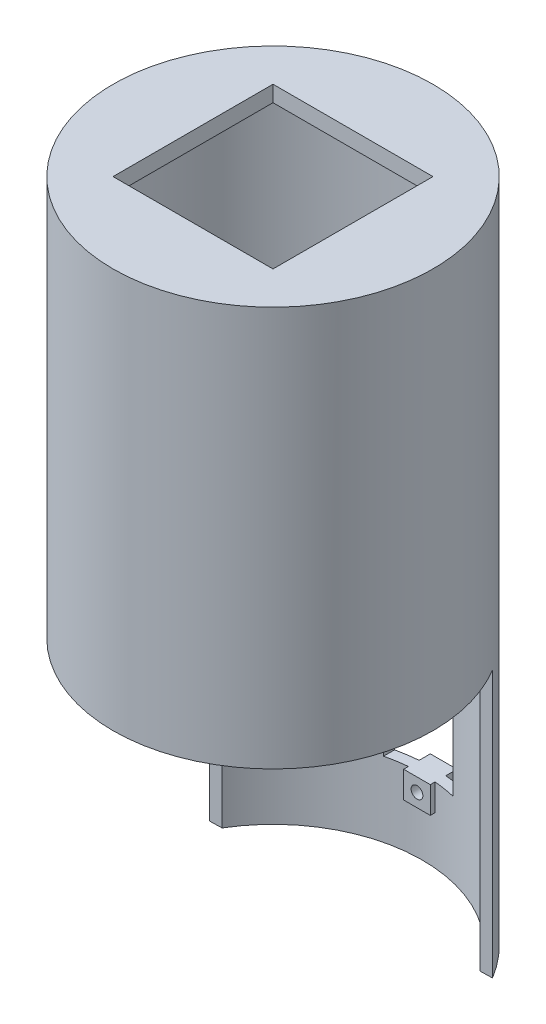
ISO-10303-21;
HEADER;
FILE_DESCRIPTION(('STEP AP214'),'2;1');
FILE_NAME('part.step','',(''),(''),'','','');
FILE_SCHEMA(('AUTOMOTIVE_DESIGN { 1 0 10303 214 1 1 1 1 }'));
ENDSEC;
DATA;
#1=APPLICATION_CONTEXT('core data for automotive mechanical design processes');
#2=APPLICATION_PROTOCOL_DEFINITION('international standard','automotive_design',2000,#1);
#3=PRODUCT_CONTEXT('',#1,'mechanical');
#4=PRODUCT('Part','Part','',(#3));
#5=PRODUCT_RELATED_PRODUCT_CATEGORY('part','',(#4));
#6=PRODUCT_DEFINITION_FORMATION('','',#4);
#7=PRODUCT_DEFINITION_CONTEXT('part definition',#1,'design');
#8=PRODUCT_DEFINITION('design','',#6,#7);
#9=PRODUCT_DEFINITION_SHAPE('','',#8);
#10=(LENGTH_UNIT() NAMED_UNIT(*) SI_UNIT(.MILLI.,.METRE.));
#11=(NAMED_UNIT(*) PLANE_ANGLE_UNIT() SI_UNIT($,.RADIAN.));
#12=(NAMED_UNIT(*) SI_UNIT($,.STERADIAN.) SOLID_ANGLE_UNIT());
#13=UNCERTAINTY_MEASURE_WITH_UNIT(LENGTH_MEASURE(1.E-05),#10,'distance_accuracy_value','');
#14=(GEOMETRIC_REPRESENTATION_CONTEXT(3) GLOBAL_UNCERTAINTY_ASSIGNED_CONTEXT((#13)) GLOBAL_UNIT_ASSIGNED_CONTEXT((#10,
#11,#12)) REPRESENTATION_CONTEXT('',''));
#15=CARTESIAN_POINT('',(0.,0.,0.));
#16=DIRECTION('',(0.,0.,1.));
#17=DIRECTION('',(1.,0.,0.));
#18=AXIS2_PLACEMENT_3D('',#15,#16,#17);
#19=CARTESIAN_POINT('',(0.,-50.,0.));
#20=DIRECTION('',(0.,1.,0.));
#21=DIRECTION('',(0.,0.,1.));
#22=AXIS2_PLACEMENT_3D('',#19,#20,#21);
#23=CYLINDRICAL_SURFACE('',#22,30.);
#24=DIRECTION('',(0.,1.,0.));
#25=VECTOR('',#24,1.);
#26=CARTESIAN_POINT('',(-26.3258578801565,-54.,-14.385729278483));
#27=LINE('',#26,#25);
#28=CARTESIAN_POINT('',(-26.3258578801565,-50.,-14.3857292784829));
#29=VERTEX_POINT('',#28);
#30=CARTESIAN_POINT('',(-26.3258578801565,0.,-14.385729278483));
#31=VERTEX_POINT('',#30);
#32=EDGE_CURVE('E439',#29,#31,#27,.T.);
#33=ORIENTED_EDGE('',*,*,#32,.T.);
#34=CARTESIAN_POINT('',(0.,0.,0.));
#35=DIRECTION('',(0.,1.,0.));
#36=DIRECTION('',(0.,0.,1.));
#37=AXIS2_PLACEMENT_3D('',#34,#35,#36);
#38=CIRCLE('',#37,30.);
#39=CARTESIAN_POINT('',(25.7323164153394,0.,-15.4223179807983));
#40=VERTEX_POINT('',#39);
#41=EDGE_CURVE('E429',#31,#40,#38,.T.);
#42=ORIENTED_EDGE('',*,*,#41,.T.);
#43=DIRECTION('',(0.,1.,0.));
#44=VECTOR('',#43,1.);
#45=CARTESIAN_POINT('',(25.7323164153394,-54.,-15.4223179807983));
#46=LINE('',#45,#44);
#47=CARTESIAN_POINT('',(25.7323164153394,-50.,-15.4223179807983));
#48=VERTEX_POINT('',#47);
#49=EDGE_CURVE('E438',#48,#40,#46,.T.);
#50=ORIENTED_EDGE('',*,*,#49,.F.);
#51=CARTESIAN_POINT('',(0.,-50.,0.));
#52=DIRECTION('',(0.,1.,0.));
#53=DIRECTION('',(0.,0.,1.));
#54=AXIS2_PLACEMENT_3D('',#51,#52,#53);
#55=CIRCLE('',#54,30.);
#56=EDGE_CURVE('E482',#48,#29,#55,.T.);
#57=ORIENTED_EDGE('',*,*,#56,.T.);
#58=EDGE_LOOP('',(#33,#42,#50,#57));
#59=FACE_BOUND('',#58,.T.);
#60=CARTESIAN_POINT('',(0.,75.,0.));
#61=DIRECTION('',(0.,1.,0.));
#62=DIRECTION('',(0.,0.,1.));
#63=AXIS2_PLACEMENT_3D('',#60,#61,#62);
#64=CIRCLE('',#63,30.);
#65=CARTESIAN_POINT('',(0.,75.,30.));
#66=VERTEX_POINT('',#65);
#67=EDGE_CURVE('E470',#66,#66,#64,.T.);
#68=ORIENTED_EDGE('',*,*,#67,.F.);
#69=EDGE_LOOP('',(#68));
#70=FACE_BOUND('',#69,.T.);
#71=CARTESIAN_POINT('',(0.,-41.,0.));
#72=DIRECTION('',(0.,1.,0.));
#73=DIRECTION('',(0.,0.,1.));
#74=AXIS2_PLACEMENT_3D('',#71,#72,#73);
#75=CIRCLE('',#74,30.);
#76=CARTESIAN_POINT('',(-2.5,-41.,-29.8956518577535));
#77=VERTEX_POINT('',#76);
#78=CARTESIAN_POINT('',(2.5,-41.,-29.8956518577535));
#79=VERTEX_POINT('',#78);
#80=EDGE_CURVE('E306',#77,#79,#75,.F.);
#81=ORIENTED_EDGE('',*,*,#80,.T.);
#82=DIRECTION('',(0.,1.,0.));
#83=VECTOR('',#82,1.);
#84=CARTESIAN_POINT('',(2.5,-50.,-29.8956518577535));
#85=LINE('',#84,#83);
#86=CARTESIAN_POINT('',(2.5,-36.,-29.8956518577535));
#87=VERTEX_POINT('',#86);
#88=EDGE_CURVE('E303',#79,#87,#85,.T.);
#89=ORIENTED_EDGE('',*,*,#88,.T.);
#90=CARTESIAN_POINT('',(0.,-36.,0.));
#91=DIRECTION('',(0.,-1.,0.));
#92=DIRECTION('',(0.,0.,-1.));
#93=AXIS2_PLACEMENT_3D('',#90,#91,#92);
#94=CIRCLE('',#93,30.);
#95=CARTESIAN_POINT('',(6.50000000000001,-36.,-29.2873692912149));
#96=VERTEX_POINT('',#95);
#97=EDGE_CURVE('E234',#96,#87,#94,.F.);
#98=ORIENTED_EDGE('',*,*,#97,.F.);
#99=DIRECTION('',(0.,1.,0.));
#100=VECTOR('',#99,1.);
#101=CARTESIAN_POINT('',(6.50000000000001,-50.,-29.2873692912149));
#102=LINE('',#101,#100);
#103=CARTESIAN_POINT('',(6.5,-12.5,-29.2873692912149));
#104=VERTEX_POINT('',#103);
#105=EDGE_CURVE('E395',#104,#96,#102,.F.);
#106=ORIENTED_EDGE('',*,*,#105,.F.);
#107=CARTESIAN_POINT('',(0.,-12.5,0.));
#108=DIRECTION('',(0.,1.,0.));
#109=DIRECTION('',(0.,0.,1.));
#110=AXIS2_PLACEMENT_3D('',#107,#108,#109);
#111=CIRCLE('',#110,30.);
#112=CARTESIAN_POINT('',(2.5,-12.5,-29.8956518577535));
#113=VERTEX_POINT('',#112);
#114=EDGE_CURVE('E399',#113,#104,#111,.F.);
#115=ORIENTED_EDGE('',*,*,#114,.F.);
#116=DIRECTION('',(0.,1.,0.));
#117=VECTOR('',#116,1.);
#118=CARTESIAN_POINT('',(2.5,-50.,-29.8956518577535));
#119=LINE('',#118,#117);
#120=CARTESIAN_POINT('',(2.5,-7.50000000000001,-29.8956518577535));
#121=VERTEX_POINT('',#120);
#122=EDGE_CURVE('E369',#113,#121,#119,.T.);
#123=ORIENTED_EDGE('',*,*,#122,.T.);
#124=CARTESIAN_POINT('',(0.,-7.50000000000001,0.));
#125=DIRECTION('',(0.,-1.,0.));
#126=DIRECTION('',(0.,0.,-1.));
#127=AXIS2_PLACEMENT_3D('',#124,#125,#126);
#128=CIRCLE('',#127,30.);
#129=CARTESIAN_POINT('',(-2.5,-7.5,-29.8956518577535));
#130=VERTEX_POINT('',#129);
#131=EDGE_CURVE('E373',#121,#130,#128,.F.);
#132=ORIENTED_EDGE('',*,*,#131,.T.);
#133=DIRECTION('',(0.,1.,0.));
#134=VECTOR('',#133,1.);
#135=CARTESIAN_POINT('',(-2.49999999999999,-50.,-29.8956518577535));
#136=LINE('',#135,#134);
#137=CARTESIAN_POINT('',(-2.5,-12.5,-29.8956518577535));
#138=VERTEX_POINT('',#137);
#139=EDGE_CURVE('E361',#130,#138,#136,.F.);
#140=ORIENTED_EDGE('',*,*,#139,.T.);
#141=CARTESIAN_POINT('',(-6.5,-12.5,-29.2873692912149));
#142=VERTEX_POINT('',#141);
#143=EDGE_CURVE('E400',#142,#138,#111,.F.);
#144=ORIENTED_EDGE('',*,*,#143,.F.);
#145=DIRECTION('',(0.,1.,0.));
#146=VECTOR('',#145,1.);
#147=CARTESIAN_POINT('',(-6.49999999999999,-50.,-29.2873692912149));
#148=LINE('',#147,#146);
#149=CARTESIAN_POINT('',(-6.49999999999999,-36.,-29.2873692912149));
#150=VERTEX_POINT('',#149);
#151=EDGE_CURVE('E404',#150,#142,#148,.T.);
#152=ORIENTED_EDGE('',*,*,#151,.F.);
#153=CARTESIAN_POINT('',(-2.5,-36.,-29.8956518577535));
#154=VERTEX_POINT('',#153);
#155=EDGE_CURVE('E382',#154,#150,#94,.F.);
#156=ORIENTED_EDGE('',*,*,#155,.F.);
#157=DIRECTION('',(0.,1.,0.));
#158=VECTOR('',#157,1.);
#159=CARTESIAN_POINT('',(-2.5,-50.,-29.8956518577535));
#160=LINE('',#159,#158);
#161=EDGE_CURVE('E295',#154,#77,#160,.F.);
#162=ORIENTED_EDGE('',*,*,#161,.T.);
#163=EDGE_LOOP('',(#81,#89,#98,#106,#115,#123,#132,#140,#144,#152,#156,#162));
#164=FACE_BOUND('',#163,.T.);
#165=ADVANCED_FACE('F39',(#59,#70,#164),#23,.T.);
#166=CARTESIAN_POINT('',(0.,72.,0.));
#167=DIRECTION('',(0.,-1.,0.));
#168=DIRECTION('',(0.,0.,-1.));
#169=AXIS2_PLACEMENT_3D('',#166,#167,#168);
#170=CYLINDRICAL_SURFACE('',#169,28.);
#171=CARTESIAN_POINT('',(0.,72.,0.));
#172=DIRECTION('',(0.,1.,0.));
#173=DIRECTION('',(0.,0.,1.));
#174=AXIS2_PLACEMENT_3D('',#171,#172,#173);
#175=CIRCLE('',#174,28.);
#176=CARTESIAN_POINT('',(0.,72.,28.));
#177=VERTEX_POINT('',#176);
#178=EDGE_CURVE('E407',#177,#177,#175,.T.);
#179=ORIENTED_EDGE('',*,*,#178,.T.);
#180=EDGE_LOOP('',(#179));
#181=FACE_BOUND('',#180,.T.);
#182=DIRECTION('',(0.,-1.,0.));
#183=VECTOR('',#182,1.);
#184=CARTESIAN_POINT('',(23.4004728342361,72.,-15.3758860276142));
#185=LINE('',#184,#183);
#186=CARTESIAN_POINT('',(23.4004728342361,-50.,-15.3758860276142));
#187=VERTEX_POINT('',#186);
#188=CARTESIAN_POINT('',(23.4004728342361,0.,-15.3758860276142));
#189=VERTEX_POINT('',#188);
#190=EDGE_CURVE('E489',#187,#189,#185,.F.);
#191=ORIENTED_EDGE('',*,*,#190,.T.);
#192=CARTESIAN_POINT('',(0.,0.,0.));
#193=DIRECTION('',(0.,1.,0.));
#194=DIRECTION('',(0.,0.,1.));
#195=AXIS2_PLACEMENT_3D('',#192,#193,#194);
#196=CIRCLE('',#195,28.);
#197=CARTESIAN_POINT('',(-23.9940142990531,0.,-14.4321612316671));
#198=VERTEX_POINT('',#197);
#199=EDGE_CURVE('E411',#189,#198,#196,.F.);
#200=ORIENTED_EDGE('',*,*,#199,.T.);
#201=DIRECTION('',(0.,-1.,0.));
#202=VECTOR('',#201,1.);
#203=CARTESIAN_POINT('',(-23.9940142990531,72.,-14.432161231667));
#204=LINE('',#203,#202);
#205=CARTESIAN_POINT('',(-23.9940142990531,-50.,-14.432161231667));
#206=VERTEX_POINT('',#205);
#207=EDGE_CURVE('E486',#198,#206,#204,.T.);
#208=ORIENTED_EDGE('',*,*,#207,.T.);
#209=CARTESIAN_POINT('',(0.,-50.,0.));
#210=DIRECTION('',(0.,1.,0.));
#211=DIRECTION('',(0.,0.,1.));
#212=AXIS2_PLACEMENT_3D('',#209,#210,#211);
#213=CIRCLE('',#212,28.);
#214=EDGE_CURVE('E414',#206,#187,#213,.F.);
#215=ORIENTED_EDGE('',*,*,#214,.T.);
#216=EDGE_LOOP('',(#191,#200,#208,#215));
#217=FACE_BOUND('',#216,.T.);
#218=CARTESIAN_POINT('',(0.,-36.,0.));
#219=DIRECTION('',(0.,-1.,0.));
#220=DIRECTION('',(0.,0.,-1.));
#221=AXIS2_PLACEMENT_3D('',#218,#219,#220);
#222=CIRCLE('',#221,28.);
#223=CARTESIAN_POINT('',(2.5,-36.,-27.8881695347687));
#224=VERTEX_POINT('',#223);
#225=CARTESIAN_POINT('',(6.50000000000001,-36.,-27.2350876627926));
#226=VERTEX_POINT('',#225);
#227=EDGE_CURVE('E496',#224,#226,#222,.T.);
#228=ORIENTED_EDGE('',*,*,#227,.F.);
#229=DIRECTION('',(0.,-1.,0.));
#230=VECTOR('',#229,1.);
#231=CARTESIAN_POINT('',(2.49999999999999,72.,-27.8881695347687));
#232=LINE('',#231,#230);
#233=CARTESIAN_POINT('',(2.5,-41.,-27.8881695347687));
#234=VERTEX_POINT('',#233);
#235=EDGE_CURVE('E299',#224,#234,#232,.T.);
#236=ORIENTED_EDGE('',*,*,#235,.T.);
#237=CARTESIAN_POINT('',(0.,-41.,0.));
#238=DIRECTION('',(0.,1.,0.));
#239=DIRECTION('',(0.,0.,1.));
#240=AXIS2_PLACEMENT_3D('',#237,#238,#239);
#241=CIRCLE('',#240,28.);
#242=CARTESIAN_POINT('',(-2.5,-41.,-27.8881695347687));
#243=VERTEX_POINT('',#242);
#244=EDGE_CURVE('E11',#234,#243,#241,.T.);
#245=ORIENTED_EDGE('',*,*,#244,.T.);
#246=DIRECTION('',(0.,-1.,0.));
#247=VECTOR('',#246,1.);
#248=CARTESIAN_POINT('',(-2.49999999999999,72.,-27.8881695347687));
#249=LINE('',#248,#247);
#250=CARTESIAN_POINT('',(-2.5,-36.,-27.8881695347687));
#251=VERTEX_POINT('',#250);
#252=EDGE_CURVE('E291',#243,#251,#249,.F.);
#253=ORIENTED_EDGE('',*,*,#252,.T.);
#254=CARTESIAN_POINT('',(-6.49999999999999,-36.,-27.2350876627926));
#255=VERTEX_POINT('',#254);
#256=EDGE_CURVE('E497',#255,#251,#222,.T.);
#257=ORIENTED_EDGE('',*,*,#256,.F.);
#258=DIRECTION('',(0.,-1.,0.));
#259=VECTOR('',#258,1.);
#260=CARTESIAN_POINT('',(-6.50000000000001,72.,-27.2350876627926));
#261=LINE('',#260,#259);
#262=CARTESIAN_POINT('',(-6.5,-12.5,-27.2350876627926));
#263=VERTEX_POINT('',#262);
#264=EDGE_CURVE('E508',#263,#255,#261,.T.);
#265=ORIENTED_EDGE('',*,*,#264,.F.);
#266=CARTESIAN_POINT('',(0.,-12.5,0.));
#267=DIRECTION('',(0.,1.,0.));
#268=DIRECTION('',(0.,0.,1.));
#269=AXIS2_PLACEMENT_3D('',#266,#267,#268);
#270=CIRCLE('',#269,28.);
#271=CARTESIAN_POINT('',(-2.5,-12.5,-27.8881695347687));
#272=VERTEX_POINT('',#271);
#273=EDGE_CURVE('E503',#272,#263,#270,.T.);
#274=ORIENTED_EDGE('',*,*,#273,.F.);
#275=DIRECTION('',(0.,-1.,0.));
#276=VECTOR('',#275,1.);
#277=CARTESIAN_POINT('',(-2.50000000000002,72.,-27.8881695347687));
#278=LINE('',#277,#276);
#279=CARTESIAN_POINT('',(-2.5,-7.5,-27.8881695347687));
#280=VERTEX_POINT('',#279);
#281=EDGE_CURVE('E357',#272,#280,#278,.F.);
#282=ORIENTED_EDGE('',*,*,#281,.T.);
#283=CARTESIAN_POINT('',(0.,-7.50000000000001,0.));
#284=DIRECTION('',(0.,-1.,0.));
#285=DIRECTION('',(0.,0.,-1.));
#286=AXIS2_PLACEMENT_3D('',#283,#284,#285);
#287=CIRCLE('',#286,28.);
#288=CARTESIAN_POINT('',(2.5,-7.50000000000001,-27.8881695347687));
#289=VERTEX_POINT('',#288);
#290=EDGE_CURVE('E48',#280,#289,#287,.T.);
#291=ORIENTED_EDGE('',*,*,#290,.T.);
#292=DIRECTION('',(0.,-1.,0.));
#293=VECTOR('',#292,1.);
#294=CARTESIAN_POINT('',(2.49999999999999,72.,-27.8881695347687));
#295=LINE('',#294,#293);
#296=CARTESIAN_POINT('',(2.5,-12.5,-27.8881695347687));
#297=VERTEX_POINT('',#296);
#298=EDGE_CURVE('E365',#289,#297,#295,.T.);
#299=ORIENTED_EDGE('',*,*,#298,.T.);
#300=CARTESIAN_POINT('',(6.5,-12.5,-27.2350876627926));
#301=VERTEX_POINT('',#300);
#302=EDGE_CURVE('E504',#301,#297,#270,.T.);
#303=ORIENTED_EDGE('',*,*,#302,.F.);
#304=DIRECTION('',(0.,-1.,0.));
#305=VECTOR('',#304,1.);
#306=CARTESIAN_POINT('',(6.49999999999999,72.,-27.2350876627926));
#307=LINE('',#306,#305);
#308=EDGE_CURVE('E500',#226,#301,#307,.F.);
#309=ORIENTED_EDGE('',*,*,#308,.F.);
#310=EDGE_LOOP('',(#228,#236,#245,#253,#257,#265,#274,#282,#291,#299,#303,#309));
#311=FACE_BOUND('',#310,.T.);
#312=ADVANCED_FACE('F554',(#181,#217,#311),#170,.F.);
#313=CARTESIAN_POINT('',(25.7323164153394,-54.,-15.4223179807983));
#314=DIRECTION('',(-0.0199081753741811,0.,-0.99980181263752));
#315=DIRECTION('',(-0.99980181263752,0.,0.0199081753741811));
#316=AXIS2_PLACEMENT_3D('',#313,#314,#315);
#317=PLANE('',#316);
#318=ORIENTED_EDGE('',*,*,#190,.F.);
#319=DIRECTION('',(-0.99980181263752,0.,0.0199081753741811));
#320=VECTOR('',#319,1.);
#321=CARTESIAN_POINT('',(-0.296770732408542,-50.,-14.9040236296406));
#322=LINE('',#321,#320);
#323=EDGE_CURVE('E446',#48,#187,#322,.T.);
#324=ORIENTED_EDGE('',*,*,#323,.F.);
#325=ORIENTED_EDGE('',*,*,#49,.T.);
#326=DIRECTION('',(-0.99980181263752,0.,0.0199081753741811));
#327=VECTOR('',#326,1.);
#328=CARTESIAN_POINT('',(25.7323164153394,0.,-15.4223179807983));
#329=LINE('',#328,#327);
#330=EDGE_CURVE('E434',#40,#189,#329,.T.);
#331=ORIENTED_EDGE('',*,*,#330,.T.);
#332=EDGE_LOOP('',(#318,#324,#325,#331));
#333=FACE_BOUND('',#332,.T.);
#334=ADVANCED_FACE('F623',(#333),#317,.F.);
#335=ORIENTED_EDGE('',*,*,#207,.F.);
#336=EDGE_CURVE('E433',#198,#31,#329,.T.);
#337=ORIENTED_EDGE('',*,*,#336,.T.);
#338=ORIENTED_EDGE('',*,*,#32,.F.);
#339=EDGE_CURVE('E443',#206,#29,#322,.T.);
#340=ORIENTED_EDGE('',*,*,#339,.F.);
#341=EDGE_LOOP('',(#335,#337,#338,#340));
#342=FACE_BOUND('',#341,.T.);
#343=ADVANCED_FACE('F643',(#342),#317,.F.);
#344=CARTESIAN_POINT('',(0.,-50.,0.));
#345=DIRECTION('',(0.,1.,0.));
#346=DIRECTION('',(0.,0.,1.));
#347=AXIS2_PLACEMENT_3D('',#344,#345,#346);
#348=PLANE('',#347);
#349=ORIENTED_EDGE('',*,*,#214,.F.);
#350=ORIENTED_EDGE('',*,*,#339,.T.);
#351=ORIENTED_EDGE('',*,*,#56,.F.);
#352=ORIENTED_EDGE('',*,*,#323,.T.);
#353=EDGE_LOOP('',(#349,#350,#351,#352));
#354=FACE_BOUND('',#353,.T.);
#355=ADVANCED_FACE('F633',(#354),#348,.F.);
#356=CARTESIAN_POINT('',(0.,75.,0.));
#357=DIRECTION('',(0.,1.,0.));
#358=DIRECTION('',(0.,0.,1.));
#359=AXIS2_PLACEMENT_3D('',#356,#357,#358);
#360=PLANE('',#359);
#361=DIRECTION('',(-1.,0.,0.));
#362=VECTOR('',#361,1.);
#363=CARTESIAN_POINT('',(-15.,75.,-15.));
#364=LINE('',#363,#362);
#365=CARTESIAN_POINT('',(15.,75.,-15.));
#366=VERTEX_POINT('',#365);
#367=CARTESIAN_POINT('',(-15.,75.,-15.));
#368=VERTEX_POINT('',#367);
#369=EDGE_CURVE('E450',#366,#368,#364,.T.);
#370=ORIENTED_EDGE('',*,*,#369,.F.);
#371=DIRECTION('',(0.,0.,-1.));
#372=VECTOR('',#371,1.);
#373=CARTESIAN_POINT('',(15.,75.,-15.));
#374=LINE('',#373,#372);
#375=CARTESIAN_POINT('',(15.,75.,15.));
#376=VERTEX_POINT('',#375);
#377=EDGE_CURVE('E462',#376,#366,#374,.T.);
#378=ORIENTED_EDGE('',*,*,#377,.F.);
#379=DIRECTION('',(1.,0.,0.));
#380=VECTOR('',#379,1.);
#381=CARTESIAN_POINT('',(-15.,75.,15.));
#382=LINE('',#381,#380);
#383=CARTESIAN_POINT('',(-15.,75.,15.));
#384=VERTEX_POINT('',#383);
#385=EDGE_CURVE('E458',#384,#376,#382,.T.);
#386=ORIENTED_EDGE('',*,*,#385,.F.);
#387=DIRECTION('',(0.,0.,1.));
#388=VECTOR('',#387,1.);
#389=CARTESIAN_POINT('',(-15.,75.,-15.));
#390=LINE('',#389,#388);
#391=EDGE_CURVE('E454',#368,#384,#390,.T.);
#392=ORIENTED_EDGE('',*,*,#391,.F.);
#393=EDGE_LOOP('',(#370,#378,#386,#392));
#394=FACE_BOUND('',#393,.T.);
#395=ORIENTED_EDGE('',*,*,#67,.T.);
#396=EDGE_LOOP('',(#395));
#397=FACE_BOUND('',#396,.T.);
#398=ADVANCED_FACE('F630',(#394,#397),#360,.T.);
#399=CARTESIAN_POINT('',(-15.,29.9,-15.));
#400=DIRECTION('',(0.,0.,-1.));
#401=DIRECTION('',(-1.,0.,0.));
#402=AXIS2_PLACEMENT_3D('',#399,#400,#401);
#403=PLANE('',#402);
#404=DIRECTION('',(0.,1.,0.));
#405=VECTOR('',#404,1.);
#406=CARTESIAN_POINT('',(-15.,29.9,-15.));
#407=LINE('',#406,#405);
#408=CARTESIAN_POINT('',(-15.,72.,-15.));
#409=VERTEX_POINT('',#408);
#410=EDGE_CURVE('E466',#409,#368,#407,.T.);
#411=ORIENTED_EDGE('',*,*,#410,.F.);
#412=DIRECTION('',(1.,0.,0.));
#413=VECTOR('',#412,1.);
#414=CARTESIAN_POINT('',(-15.,72.,-15.));
#415=LINE('',#414,#413);
#416=CARTESIAN_POINT('',(15.,72.,-15.));
#417=VERTEX_POINT('',#416);
#418=EDGE_CURVE('E425',#409,#417,#415,.T.);
#419=ORIENTED_EDGE('',*,*,#418,.T.);
#420=DIRECTION('',(0.,1.,0.));
#421=VECTOR('',#420,1.);
#422=CARTESIAN_POINT('',(15.,29.9,-15.));
#423=LINE('',#422,#421);
#424=EDGE_CURVE('E467',#417,#366,#423,.T.);
#425=ORIENTED_EDGE('',*,*,#424,.T.);
#426=ORIENTED_EDGE('',*,*,#369,.T.);
#427=EDGE_LOOP('',(#411,#419,#425,#426));
#428=FACE_BOUND('',#427,.T.);
#429=ADVANCED_FACE('F632',(#428),#403,.F.);
#430=CARTESIAN_POINT('',(15.,29.9,-15.));
#431=DIRECTION('',(1.,0.,0.));
#432=DIRECTION('',(0.,0.,-1.));
#433=AXIS2_PLACEMENT_3D('',#430,#431,#432);
#434=PLANE('',#433);
#435=ORIENTED_EDGE('',*,*,#424,.F.);
#436=DIRECTION('',(0.,0.,1.));
#437=VECTOR('',#436,1.);
#438=CARTESIAN_POINT('',(15.,72.,-15.));
#439=LINE('',#438,#437);
#440=CARTESIAN_POINT('',(15.,72.,15.));
#441=VERTEX_POINT('',#440);
#442=EDGE_CURVE('E421',#417,#441,#439,.T.);
#443=ORIENTED_EDGE('',*,*,#442,.T.);
#444=DIRECTION('',(0.,1.,0.));
#445=VECTOR('',#444,1.);
#446=CARTESIAN_POINT('',(15.,29.9,15.));
#447=LINE('',#446,#445);
#448=EDGE_CURVE('E471',#441,#376,#447,.T.);
#449=ORIENTED_EDGE('',*,*,#448,.T.);
#450=ORIENTED_EDGE('',*,*,#377,.T.);
#451=EDGE_LOOP('',(#435,#443,#449,#450));
#452=FACE_BOUND('',#451,.T.);
#453=ADVANCED_FACE('F640',(#452),#434,.F.);
#454=CARTESIAN_POINT('',(-15.,29.9,15.));
#455=DIRECTION('',(0.,0.,1.));
#456=DIRECTION('',(1.,0.,0.));
#457=AXIS2_PLACEMENT_3D('',#454,#455,#456);
#458=PLANE('',#457);
#459=ORIENTED_EDGE('',*,*,#448,.F.);
#460=DIRECTION('',(-1.,0.,0.));
#461=VECTOR('',#460,1.);
#462=CARTESIAN_POINT('',(-15.,72.,15.));
#463=LINE('',#462,#461);
#464=CARTESIAN_POINT('',(-15.,72.,15.));
#465=VERTEX_POINT('',#464);
#466=EDGE_CURVE('E417',#441,#465,#463,.T.);
#467=ORIENTED_EDGE('',*,*,#466,.T.);
#468=DIRECTION('',(0.,1.,0.));
#469=VECTOR('',#468,1.);
#470=CARTESIAN_POINT('',(-15.,29.9,15.));
#471=LINE('',#470,#469);
#472=EDGE_CURVE('E474',#465,#384,#471,.T.);
#473=ORIENTED_EDGE('',*,*,#472,.T.);
#474=ORIENTED_EDGE('',*,*,#385,.T.);
#475=EDGE_LOOP('',(#459,#467,#473,#474));
#476=FACE_BOUND('',#475,.T.);
#477=ADVANCED_FACE('F651',(#476),#458,.F.);
#478=CARTESIAN_POINT('',(-15.,29.9,-15.));
#479=DIRECTION('',(-1.,0.,0.));
#480=DIRECTION('',(0.,0.,1.));
#481=AXIS2_PLACEMENT_3D('',#478,#479,#480);
#482=PLANE('',#481);
#483=ORIENTED_EDGE('',*,*,#472,.F.);
#484=DIRECTION('',(0.,0.,-1.));
#485=VECTOR('',#484,1.);
#486=CARTESIAN_POINT('',(-15.,72.,-15.));
#487=LINE('',#486,#485);
#488=EDGE_CURVE('E492',#465,#409,#487,.T.);
#489=ORIENTED_EDGE('',*,*,#488,.T.);
#490=ORIENTED_EDGE('',*,*,#410,.T.);
#491=ORIENTED_EDGE('',*,*,#391,.T.);
#492=EDGE_LOOP('',(#483,#489,#490,#491));
#493=FACE_BOUND('',#492,.T.);
#494=ADVANCED_FACE('F647',(#493),#482,.F.);
#495=CARTESIAN_POINT('',(0.,0.,0.));
#496=DIRECTION('',(0.,1.,0.));
#497=DIRECTION('',(0.,0.,1.));
#498=AXIS2_PLACEMENT_3D('',#495,#496,#497);
#499=PLANE('',#498);
#500=ORIENTED_EDGE('',*,*,#199,.F.);
#501=ORIENTED_EDGE('',*,*,#330,.F.);
#502=ORIENTED_EDGE('',*,*,#41,.F.);
#503=ORIENTED_EDGE('',*,*,#336,.F.);
#504=EDGE_LOOP('',(#500,#501,#502,#503));
#505=FACE_BOUND('',#504,.T.);
#506=ADVANCED_FACE('F650',(#505),#499,.F.);
#507=CARTESIAN_POINT('',(0.,72.,0.));
#508=DIRECTION('',(0.,1.,0.));
#509=DIRECTION('',(0.,0.,1.));
#510=AXIS2_PLACEMENT_3D('',#507,#508,#509);
#511=PLANE('',#510);
#512=ORIENTED_EDGE('',*,*,#178,.F.);
#513=EDGE_LOOP('',(#512));
#514=FACE_BOUND('',#513,.T.);
#515=ORIENTED_EDGE('',*,*,#488,.F.);
#516=ORIENTED_EDGE('',*,*,#466,.F.);
#517=ORIENTED_EDGE('',*,*,#442,.F.);
#518=ORIENTED_EDGE('',*,*,#418,.F.);
#519=EDGE_LOOP('',(#515,#516,#517,#518));
#520=FACE_BOUND('',#519,.T.);
#521=ADVANCED_FACE('F663',(#514,#520),#511,.F.);
#522=CARTESIAN_POINT('',(-6.5,-12.5,-54.));
#523=DIRECTION('',(-1.,0.,0.));
#524=DIRECTION('',(0.,-1.,0.));
#525=AXIS2_PLACEMENT_3D('',#522,#523,#524);
#526=PLANE('',#525);
#527=ORIENTED_EDGE('',*,*,#151,.T.);
#528=DIRECTION('',(0.,0.,1.));
#529=VECTOR('',#528,1.);
#530=CARTESIAN_POINT('',(-6.5,-12.5,-54.));
#531=LINE('',#530,#529);
#532=EDGE_CURVE('E378',#142,#263,#531,.T.);
#533=ORIENTED_EDGE('',*,*,#532,.T.);
#534=ORIENTED_EDGE('',*,*,#264,.T.);
#535=DIRECTION('',(0.,0.,1.));
#536=VECTOR('',#535,1.);
#537=CARTESIAN_POINT('',(-6.49999999999999,-36.,-54.));
#538=LINE('',#537,#536);
#539=EDGE_CURVE('E377',#150,#255,#538,.T.);
#540=ORIENTED_EDGE('',*,*,#539,.F.);
#541=EDGE_LOOP('',(#527,#533,#534,#540));
#542=FACE_BOUND('',#541,.T.);
#543=ADVANCED_FACE('F593',(#542),#526,.F.);
#544=CARTESIAN_POINT('',(-6.5,-12.5,-54.));
#545=DIRECTION('',(0.,1.,0.));
#546=DIRECTION('',(0.,0.,1.));
#547=AXIS2_PLACEMENT_3D('',#544,#545,#546);
#548=PLANE('',#547);
#549=ORIENTED_EDGE('',*,*,#143,.T.);
#550=DIRECTION('',(0.,0.,-1.));
#551=VECTOR('',#550,1.);
#552=CARTESIAN_POINT('',(-2.5,-12.5,-27.));
#553=LINE('',#552,#551);
#554=CARTESIAN_POINT('',(-2.5,-12.5,-32.));
#555=VERTEX_POINT('',#554);
#556=EDGE_CURVE('E343',#138,#555,#553,.T.);
#557=ORIENTED_EDGE('',*,*,#556,.T.);
#558=DIRECTION('',(1.,0.,0.));
#559=VECTOR('',#558,1.);
#560=CARTESIAN_POINT('',(2.5,-12.5,-32.));
#561=LINE('',#560,#559);
#562=CARTESIAN_POINT('',(2.5,-12.5,-32.));
#563=VERTEX_POINT('',#562);
#564=EDGE_CURVE('E322',#555,#563,#561,.T.);
#565=ORIENTED_EDGE('',*,*,#564,.T.);
#566=DIRECTION('',(0.,0.,-1.));
#567=VECTOR('',#566,1.);
#568=CARTESIAN_POINT('',(2.5,-12.5,-27.));
#569=LINE('',#568,#567);
#570=EDGE_CURVE('E339',#113,#563,#569,.T.);
#571=ORIENTED_EDGE('',*,*,#570,.F.);
#572=ORIENTED_EDGE('',*,*,#114,.T.);
#573=DIRECTION('',(0.,0.,1.));
#574=VECTOR('',#573,1.);
#575=CARTESIAN_POINT('',(6.5,-12.5,-54.));
#576=LINE('',#575,#574);
#577=EDGE_CURVE('E383',#104,#301,#576,.T.);
#578=ORIENTED_EDGE('',*,*,#577,.T.);
#579=ORIENTED_EDGE('',*,*,#302,.T.);
#580=CARTESIAN_POINT('',(2.5,-12.5,-27.));
#581=VERTEX_POINT('',#580);
#582=EDGE_CURVE('E340',#581,#297,#569,.T.);
#583=ORIENTED_EDGE('',*,*,#582,.F.);
#584=DIRECTION('',(1.,0.,0.));
#585=VECTOR('',#584,1.);
#586=CARTESIAN_POINT('',(2.5,-12.5,-27.));
#587=LINE('',#586,#585);
#588=CARTESIAN_POINT('',(-2.5,-12.5,-27.));
#589=VERTEX_POINT('',#588);
#590=EDGE_CURVE('E336',#589,#581,#587,.T.);
#591=ORIENTED_EDGE('',*,*,#590,.F.);
#592=EDGE_CURVE('E344',#589,#272,#553,.T.);
#593=ORIENTED_EDGE('',*,*,#592,.T.);
#594=ORIENTED_EDGE('',*,*,#273,.T.);
#595=ORIENTED_EDGE('',*,*,#532,.F.);
#596=EDGE_LOOP('',(#549,#557,#565,#571,#572,#578,#579,#583,#591,#593,#594,#595));
#597=FACE_BOUND('',#596,.T.);
#598=ADVANCED_FACE('F563',(#597),#548,.F.);
#599=CARTESIAN_POINT('',(6.5,-12.5,-54.));
#600=DIRECTION('',(1.,0.,0.));
#601=DIRECTION('',(0.,1.,0.));
#602=AXIS2_PLACEMENT_3D('',#599,#600,#601);
#603=PLANE('',#602);
#604=ORIENTED_EDGE('',*,*,#105,.T.);
#605=DIRECTION('',(0.,0.,1.));
#606=VECTOR('',#605,1.);
#607=CARTESIAN_POINT('',(6.50000000000001,-36.,-54.));
#608=LINE('',#607,#606);
#609=EDGE_CURVE('E387',#96,#226,#608,.T.);
#610=ORIENTED_EDGE('',*,*,#609,.T.);
#611=ORIENTED_EDGE('',*,*,#308,.T.);
#612=ORIENTED_EDGE('',*,*,#577,.F.);
#613=EDGE_LOOP('',(#604,#610,#611,#612));
#614=FACE_BOUND('',#613,.T.);
#615=ADVANCED_FACE('F567',(#614),#603,.F.);
#616=CARTESIAN_POINT('',(-6.49999999999999,-36.,-54.));
#617=DIRECTION('',(0.,-1.,0.));
#618=DIRECTION('',(0.,0.,-1.));
#619=AXIS2_PLACEMENT_3D('',#616,#617,#618);
#620=PLANE('',#619);
#621=ORIENTED_EDGE('',*,*,#256,.T.);
#622=DIRECTION('',(0.,0.,-1.));
#623=VECTOR('',#622,1.);
#624=CARTESIAN_POINT('',(-2.5,-36.,-27.));
#625=LINE('',#624,#623);
#626=CARTESIAN_POINT('',(-2.5,-36.,-27.));
#627=VERTEX_POINT('',#626);
#628=EDGE_CURVE('E240',#627,#251,#625,.T.);
#629=ORIENTED_EDGE('',*,*,#628,.F.);
#630=DIRECTION('',(-1.,0.,0.));
#631=VECTOR('',#630,1.);
#632=CARTESIAN_POINT('',(2.5,-36.,-27.));
#633=LINE('',#632,#631);
#634=CARTESIAN_POINT('',(2.5,-36.,-27.));
#635=VERTEX_POINT('',#634);
#636=EDGE_CURVE('E270',#635,#627,#633,.T.);
#637=ORIENTED_EDGE('',*,*,#636,.F.);
#638=DIRECTION('',(0.,0.,-1.));
#639=VECTOR('',#638,1.);
#640=CARTESIAN_POINT('',(2.5,-36.,-27.));
#641=LINE('',#640,#639);
#642=EDGE_CURVE('E239',#635,#224,#641,.T.);
#643=ORIENTED_EDGE('',*,*,#642,.T.);
#644=ORIENTED_EDGE('',*,*,#227,.T.);
#645=ORIENTED_EDGE('',*,*,#609,.F.);
#646=ORIENTED_EDGE('',*,*,#97,.T.);
#647=CARTESIAN_POINT('',(2.5,-36.,-32.));
#648=VERTEX_POINT('',#647);
#649=EDGE_CURVE('E227',#87,#648,#641,.T.);
#650=ORIENTED_EDGE('',*,*,#649,.T.);
#651=DIRECTION('',(-1.,0.,0.));
#652=VECTOR('',#651,1.);
#653=CARTESIAN_POINT('',(2.5,-36.,-32.));
#654=LINE('',#653,#652);
#655=CARTESIAN_POINT('',(-2.5,-36.,-32.));
#656=VERTEX_POINT('',#655);
#657=EDGE_CURVE('E232',#648,#656,#654,.T.);
#658=ORIENTED_EDGE('',*,*,#657,.T.);
#659=EDGE_CURVE('E286',#154,#656,#625,.T.);
#660=ORIENTED_EDGE('',*,*,#659,.F.);
#661=ORIENTED_EDGE('',*,*,#155,.T.);
#662=ORIENTED_EDGE('',*,*,#539,.T.);
#663=EDGE_LOOP('',(#621,#629,#637,#643,#644,#645,#646,#650,#658,#660,#661,#662));
#664=FACE_BOUND('',#663,.T.);
#665=ADVANCED_FACE('F230',(#664),#620,.F.);
#666=CARTESIAN_POINT('',(0.,0.,-27.));
#667=DIRECTION('',(0.,0.,-1.));
#668=DIRECTION('',(-1.,0.,0.));
#669=AXIS2_PLACEMENT_3D('',#666,#667,#668);
#670=PLANE('',#669);
#671=CARTESIAN_POINT('',(0.,-10.,-27.));
#672=DIRECTION('',(0.,0.,-1.));
#673=DIRECTION('',(-1.,0.,0.));
#674=AXIS2_PLACEMENT_3D('',#671,#672,#673);
#675=CIRCLE('',#674,1.1);
#676=CARTESIAN_POINT('',(-1.1,-10.,-27.));
#677=VERTEX_POINT('',#676);
#678=EDGE_CURVE('E254',#677,#677,#675,.F.);
#679=ORIENTED_EDGE('',*,*,#678,.F.);
#680=EDGE_LOOP('',(#679));
#681=FACE_BOUND('',#680,.T.);
#682=DIRECTION('',(0.,1.,0.));
#683=VECTOR('',#682,1.);
#684=CARTESIAN_POINT('',(2.5,-7.5,-27.));
#685=LINE('',#684,#683);
#686=CARTESIAN_POINT('',(2.5,-7.5,-27.));
#687=VERTEX_POINT('',#686);
#688=EDGE_CURVE('E326',#581,#687,#685,.T.);
#689=ORIENTED_EDGE('',*,*,#688,.T.);
#690=DIRECTION('',(-1.,0.,0.));
#691=VECTOR('',#690,1.);
#692=CARTESIAN_POINT('',(2.5,-7.5,-27.));
#693=LINE('',#692,#691);
#694=CARTESIAN_POINT('',(-2.5,-7.5,-27.));
#695=VERTEX_POINT('',#694);
#696=EDGE_CURVE('E330',#687,#695,#693,.T.);
#697=ORIENTED_EDGE('',*,*,#696,.T.);
#698=DIRECTION('',(0.,-1.,0.));
#699=VECTOR('',#698,1.);
#700=CARTESIAN_POINT('',(-2.5,-7.5,-27.));
#701=LINE('',#700,#699);
#702=EDGE_CURVE('E333',#695,#589,#701,.T.);
#703=ORIENTED_EDGE('',*,*,#702,.T.);
#704=ORIENTED_EDGE('',*,*,#590,.T.);
#705=EDGE_LOOP('',(#689,#697,#703,#704));
#706=FACE_BOUND('',#705,.T.);
#707=ADVANCED_FACE('F538',(#681,#706),#670,.F.);
#708=CARTESIAN_POINT('',(-2.5,-7.5,-27.));
#709=DIRECTION('',(1.,0.,0.));
#710=DIRECTION('',(0.,1.,0.));
#711=AXIS2_PLACEMENT_3D('',#708,#709,#710);
#712=PLANE('',#711);
#713=ORIENTED_EDGE('',*,*,#281,.F.);
#714=ORIENTED_EDGE('',*,*,#592,.F.);
#715=ORIENTED_EDGE('',*,*,#702,.F.);
#716=DIRECTION('',(0.,0.,-1.));
#717=VECTOR('',#716,1.);
#718=CARTESIAN_POINT('',(-2.5,-7.5,-27.));
#719=LINE('',#718,#717);
#720=EDGE_CURVE('E348',#695,#280,#719,.T.);
#721=ORIENTED_EDGE('',*,*,#720,.T.);
#722=EDGE_LOOP('',(#713,#714,#715,#721));
#723=FACE_BOUND('',#722,.T.);
#724=ADVANCED_FACE('F541',(#723),#712,.F.);
#725=CARTESIAN_POINT('',(2.5,-7.5,-27.));
#726=DIRECTION('',(0.,-1.,0.));
#727=DIRECTION('',(0.,0.,-1.));
#728=AXIS2_PLACEMENT_3D('',#725,#726,#727);
#729=PLANE('',#728);
#730=ORIENTED_EDGE('',*,*,#290,.F.);
#731=ORIENTED_EDGE('',*,*,#720,.F.);
#732=ORIENTED_EDGE('',*,*,#696,.F.);
#733=DIRECTION('',(0.,0.,-1.));
#734=VECTOR('',#733,1.);
#735=CARTESIAN_POINT('',(2.5,-7.5,-27.));
#736=LINE('',#735,#734);
#737=EDGE_CURVE('E353',#687,#289,#736,.T.);
#738=ORIENTED_EDGE('',*,*,#737,.T.);
#739=EDGE_LOOP('',(#730,#731,#732,#738));
#740=FACE_BOUND('',#739,.T.);
#741=ADVANCED_FACE('F551',(#740),#729,.F.);
#742=CARTESIAN_POINT('',(2.5,-7.5,-27.));
#743=DIRECTION('',(-1.,0.,0.));
#744=DIRECTION('',(0.,-1.,0.));
#745=AXIS2_PLACEMENT_3D('',#742,#743,#744);
#746=PLANE('',#745);
#747=ORIENTED_EDGE('',*,*,#298,.F.);
#748=ORIENTED_EDGE('',*,*,#737,.F.);
#749=ORIENTED_EDGE('',*,*,#688,.F.);
#750=ORIENTED_EDGE('',*,*,#582,.T.);
#751=EDGE_LOOP('',(#747,#748,#749,#750));
#752=FACE_BOUND('',#751,.T.);
#753=ADVANCED_FACE('F549',(#752),#746,.F.);
#754=ORIENTED_EDGE('',*,*,#131,.F.);
#755=CARTESIAN_POINT('',(2.5,-7.5,-32.));
#756=VERTEX_POINT('',#755);
#757=EDGE_CURVE('E352',#121,#756,#736,.T.);
#758=ORIENTED_EDGE('',*,*,#757,.T.);
#759=DIRECTION('',(-1.,0.,0.));
#760=VECTOR('',#759,1.);
#761=CARTESIAN_POINT('',(2.5,-7.5,-32.));
#762=LINE('',#761,#760);
#763=CARTESIAN_POINT('',(-2.5,-7.5,-32.));
#764=VERTEX_POINT('',#763);
#765=EDGE_CURVE('E314',#756,#764,#762,.T.);
#766=ORIENTED_EDGE('',*,*,#765,.T.);
#767=EDGE_CURVE('E347',#130,#764,#719,.T.);
#768=ORIENTED_EDGE('',*,*,#767,.F.);
#769=EDGE_LOOP('',(#754,#758,#766,#768));
#770=FACE_BOUND('',#769,.T.);
#771=ADVANCED_FACE('F608',(#770),#729,.F.);
#772=ORIENTED_EDGE('',*,*,#122,.F.);
#773=ORIENTED_EDGE('',*,*,#570,.T.);
#774=DIRECTION('',(0.,1.,0.));
#775=VECTOR('',#774,1.);
#776=CARTESIAN_POINT('',(2.5,-7.5,-32.));
#777=LINE('',#776,#775);
#778=EDGE_CURVE('E310',#563,#756,#777,.T.);
#779=ORIENTED_EDGE('',*,*,#778,.T.);
#780=ORIENTED_EDGE('',*,*,#757,.F.);
#781=EDGE_LOOP('',(#772,#773,#779,#780));
#782=FACE_BOUND('',#781,.T.);
#783=ADVANCED_FACE('F605',(#782),#746,.F.);
#784=ORIENTED_EDGE('',*,*,#139,.F.);
#785=ORIENTED_EDGE('',*,*,#767,.T.);
#786=DIRECTION('',(0.,-1.,0.));
#787=VECTOR('',#786,1.);
#788=CARTESIAN_POINT('',(-2.5,-7.5,-32.));
#789=LINE('',#788,#787);
#790=EDGE_CURVE('E318',#764,#555,#789,.T.);
#791=ORIENTED_EDGE('',*,*,#790,.T.);
#792=ORIENTED_EDGE('',*,*,#556,.F.);
#793=EDGE_LOOP('',(#784,#785,#791,#792));
#794=FACE_BOUND('',#793,.T.);
#795=ADVANCED_FACE('F598',(#794),#712,.F.);
#796=CARTESIAN_POINT('',(0.,0.,-32.));
#797=DIRECTION('',(0.,0.,-1.));
#798=DIRECTION('',(-1.,0.,0.));
#799=AXIS2_PLACEMENT_3D('',#796,#797,#798);
#800=PLANE('',#799);
#801=CARTESIAN_POINT('',(0.,-10.,-32.));
#802=DIRECTION('',(0.,0.,-1.));
#803=DIRECTION('',(-1.,0.,0.));
#804=AXIS2_PLACEMENT_3D('',#801,#802,#803);
#805=CIRCLE('',#804,1.1);
#806=CARTESIAN_POINT('',(-1.1,-10.,-32.));
#807=VERTEX_POINT('',#806);
#808=EDGE_CURVE('E42',#807,#807,#805,.F.);
#809=ORIENTED_EDGE('',*,*,#808,.T.);
#810=EDGE_LOOP('',(#809));
#811=FACE_BOUND('',#810,.T.);
#812=ORIENTED_EDGE('',*,*,#778,.F.);
#813=ORIENTED_EDGE('',*,*,#564,.F.);
#814=ORIENTED_EDGE('',*,*,#790,.F.);
#815=ORIENTED_EDGE('',*,*,#765,.F.);
#816=EDGE_LOOP('',(#812,#813,#814,#815));
#817=FACE_BOUND('',#816,.T.);
#818=ADVANCED_FACE('F528',(#811,#817),#800,.T.);
#819=CARTESIAN_POINT('',(0.,0.,-27.));
#820=DIRECTION('',(0.,0.,1.));
#821=DIRECTION('',(1.,0.,0.));
#822=AXIS2_PLACEMENT_3D('',#819,#820,#821);
#823=PLANE('',#822);
#824=CARTESIAN_POINT('',(0.,-38.5,-27.));
#825=DIRECTION('',(0.,0.,1.));
#826=DIRECTION('',(1.,0.,0.));
#827=AXIS2_PLACEMENT_3D('',#824,#825,#826);
#828=CIRCLE('',#827,1.1);
#829=CARTESIAN_POINT('',(1.1,-38.5,-27.));
#830=VERTEX_POINT('',#829);
#831=EDGE_CURVE('E517',#830,#830,#828,.F.);
#832=ORIENTED_EDGE('',*,*,#831,.T.);
#833=EDGE_LOOP('',(#832));
#834=FACE_BOUND('',#833,.T.);
#835=DIRECTION('',(0.,1.,0.));
#836=VECTOR('',#835,1.);
#837=CARTESIAN_POINT('',(2.5,-41.,-27.));
#838=LINE('',#837,#836);
#839=CARTESIAN_POINT('',(2.5,-41.,-27.));
#840=VERTEX_POINT('',#839);
#841=EDGE_CURVE('E266',#840,#635,#838,.T.);
#842=ORIENTED_EDGE('',*,*,#841,.T.);
#843=ORIENTED_EDGE('',*,*,#636,.T.);
#844=DIRECTION('',(0.,-1.,0.));
#845=VECTOR('',#844,1.);
#846=CARTESIAN_POINT('',(-2.5,-41.,-27.));
#847=LINE('',#846,#845);
#848=CARTESIAN_POINT('',(-2.5,-41.,-27.));
#849=VERTEX_POINT('',#848);
#850=EDGE_CURVE('E273',#627,#849,#847,.T.);
#851=ORIENTED_EDGE('',*,*,#850,.T.);
#852=DIRECTION('',(1.,0.,0.));
#853=VECTOR('',#852,1.);
#854=CARTESIAN_POINT('',(2.5,-41.,-27.));
#855=LINE('',#854,#853);
#856=EDGE_CURVE('E276',#849,#840,#855,.T.);
#857=ORIENTED_EDGE('',*,*,#856,.T.);
#858=EDGE_LOOP('',(#842,#843,#851,#857));
#859=FACE_BOUND('',#858,.T.);
#860=ADVANCED_FACE('F738',(#834,#859),#823,.T.);
#861=CARTESIAN_POINT('',(2.5,-41.,-27.));
#862=DIRECTION('',(0.,1.,0.));
#863=DIRECTION('',(0.,0.,1.));
#864=AXIS2_PLACEMENT_3D('',#861,#862,#863);
#865=PLANE('',#864);
#866=ORIENTED_EDGE('',*,*,#244,.F.);
#867=DIRECTION('',(0.,0.,-1.));
#868=VECTOR('',#867,1.);
#869=CARTESIAN_POINT('',(2.5,-41.,-27.));
#870=LINE('',#869,#868);
#871=EDGE_CURVE('E279',#840,#234,#870,.T.);
#872=ORIENTED_EDGE('',*,*,#871,.F.);
#873=ORIENTED_EDGE('',*,*,#856,.F.);
#874=DIRECTION('',(0.,0.,-1.));
#875=VECTOR('',#874,1.);
#876=CARTESIAN_POINT('',(-2.5,-41.,-27.));
#877=LINE('',#876,#875);
#878=EDGE_CURVE('E64',#849,#243,#877,.T.);
#879=ORIENTED_EDGE('',*,*,#878,.T.);
#880=EDGE_LOOP('',(#866,#872,#873,#879));
#881=FACE_BOUND('',#880,.T.);
#882=ADVANCED_FACE('F732',(#881),#865,.F.);
#883=CARTESIAN_POINT('',(-2.5,-41.,-27.));
#884=DIRECTION('',(1.,0.,0.));
#885=DIRECTION('',(0.,1.,0.));
#886=AXIS2_PLACEMENT_3D('',#883,#884,#885);
#887=PLANE('',#886);
#888=ORIENTED_EDGE('',*,*,#252,.F.);
#889=ORIENTED_EDGE('',*,*,#878,.F.);
#890=ORIENTED_EDGE('',*,*,#850,.F.);
#891=ORIENTED_EDGE('',*,*,#628,.T.);
#892=EDGE_LOOP('',(#888,#889,#890,#891));
#893=FACE_BOUND('',#892,.T.);
#894=ADVANCED_FACE('F737',(#893),#887,.F.);
#895=CARTESIAN_POINT('',(2.5,-41.,-27.));
#896=DIRECTION('',(-1.,0.,0.));
#897=DIRECTION('',(0.,-1.,0.));
#898=AXIS2_PLACEMENT_3D('',#895,#896,#897);
#899=PLANE('',#898);
#900=ORIENTED_EDGE('',*,*,#235,.F.);
#901=ORIENTED_EDGE('',*,*,#642,.F.);
#902=ORIENTED_EDGE('',*,*,#841,.F.);
#903=ORIENTED_EDGE('',*,*,#871,.T.);
#904=EDGE_LOOP('',(#900,#901,#902,#903));
#905=FACE_BOUND('',#904,.T.);
#906=ADVANCED_FACE('F749',(#905),#899,.F.);
#907=ORIENTED_EDGE('',*,*,#80,.F.);
#908=CARTESIAN_POINT('',(-2.5,-41.,-32.));
#909=VERTEX_POINT('',#908);
#910=EDGE_CURVE('E283',#77,#909,#877,.T.);
#911=ORIENTED_EDGE('',*,*,#910,.T.);
#912=DIRECTION('',(1.,0.,0.));
#913=VECTOR('',#912,1.);
#914=CARTESIAN_POINT('',(2.5,-41.,-32.));
#915=LINE('',#914,#913);
#916=CARTESIAN_POINT('',(2.5,-41.,-32.));
#917=VERTEX_POINT('',#916);
#918=EDGE_CURVE('E263',#909,#917,#915,.T.);
#919=ORIENTED_EDGE('',*,*,#918,.T.);
#920=EDGE_CURVE('E56',#79,#917,#870,.T.);
#921=ORIENTED_EDGE('',*,*,#920,.F.);
#922=EDGE_LOOP('',(#907,#911,#919,#921));
#923=FACE_BOUND('',#922,.T.);
#924=ADVANCED_FACE('F583',(#923),#865,.F.);
#925=ORIENTED_EDGE('',*,*,#88,.F.);
#926=ORIENTED_EDGE('',*,*,#920,.T.);
#927=DIRECTION('',(0.,1.,0.));
#928=VECTOR('',#927,1.);
#929=CARTESIAN_POINT('',(2.5,-41.,-32.));
#930=LINE('',#929,#928);
#931=EDGE_CURVE('E247',#917,#648,#930,.T.);
#932=ORIENTED_EDGE('',*,*,#931,.T.);
#933=ORIENTED_EDGE('',*,*,#649,.F.);
#934=EDGE_LOOP('',(#925,#926,#932,#933));
#935=FACE_BOUND('',#934,.T.);
#936=ADVANCED_FACE('F252',(#935),#899,.F.);
#937=ORIENTED_EDGE('',*,*,#161,.F.);
#938=ORIENTED_EDGE('',*,*,#659,.T.);
#939=DIRECTION('',(0.,-1.,0.));
#940=VECTOR('',#939,1.);
#941=CARTESIAN_POINT('',(-2.5,-41.,-32.));
#942=LINE('',#941,#940);
#943=EDGE_CURVE('E249',#656,#909,#942,.T.);
#944=ORIENTED_EDGE('',*,*,#943,.T.);
#945=ORIENTED_EDGE('',*,*,#910,.F.);
#946=EDGE_LOOP('',(#937,#938,#944,#945));
#947=FACE_BOUND('',#946,.T.);
#948=ADVANCED_FACE('F585',(#947),#887,.F.);
#949=CARTESIAN_POINT('',(0.,0.,-32.));
#950=DIRECTION('',(0.,0.,1.));
#951=DIRECTION('',(1.,0.,0.));
#952=AXIS2_PLACEMENT_3D('',#949,#950,#951);
#953=PLANE('',#952);
#954=CARTESIAN_POINT('',(0.,-38.5,-32.));
#955=DIRECTION('',(0.,0.,1.));
#956=DIRECTION('',(1.,0.,0.));
#957=AXIS2_PLACEMENT_3D('',#954,#955,#956);
#958=CIRCLE('',#957,1.1);
#959=CARTESIAN_POINT('',(1.1,-38.5,-32.));
#960=VERTEX_POINT('',#959);
#961=EDGE_CURVE('E514',#960,#960,#958,.F.);
#962=ORIENTED_EDGE('',*,*,#961,.F.);
#963=EDGE_LOOP('',(#962));
#964=FACE_BOUND('',#963,.T.);
#965=ORIENTED_EDGE('',*,*,#931,.F.);
#966=ORIENTED_EDGE('',*,*,#918,.F.);
#967=ORIENTED_EDGE('',*,*,#943,.F.);
#968=ORIENTED_EDGE('',*,*,#657,.F.);
#969=EDGE_LOOP('',(#965,#966,#967,#968));
#970=FACE_BOUND('',#969,.T.);
#971=ADVANCED_FACE('F245',(#964,#970),#953,.F.);
#972=CARTESIAN_POINT('',(0.,-38.5,-24.));
#973=DIRECTION('',(0.,0.,-1.));
#974=DIRECTION('',(-1.,0.,0.));
#975=AXIS2_PLACEMENT_3D('',#972,#973,#974);
#976=CYLINDRICAL_SURFACE('',#975,1.1);
#977=ORIENTED_EDGE('',*,*,#831,.F.);
#978=EDGE_LOOP('',(#977));
#979=FACE_BOUND('',#978,.T.);
#980=ORIENTED_EDGE('',*,*,#961,.T.);
#981=EDGE_LOOP('',(#980));
#982=FACE_BOUND('',#981,.T.);
#983=ADVANCED_FACE('F534',(#979,#982),#976,.F.);
#984=CARTESIAN_POINT('',(0.,-10.,-24.));
#985=DIRECTION('',(0.,0.,-1.));
#986=DIRECTION('',(-1.,0.,0.));
#987=AXIS2_PLACEMENT_3D('',#984,#985,#986);
#988=CYLINDRICAL_SURFACE('',#987,1.1);
#989=ORIENTED_EDGE('',*,*,#808,.F.);
#990=EDGE_LOOP('',(#989));
#991=FACE_BOUND('',#990,.T.);
#992=ORIENTED_EDGE('',*,*,#678,.T.);
#993=EDGE_LOOP('',(#992));
#994=FACE_BOUND('',#993,.T.);
#995=ADVANCED_FACE('F531',(#991,#994),#988,.F.);
#996=CLOSED_SHELL('',(#165,#312,#334,#343,#355,#398,#429,#453,#477,#494,#506,#521,#543,#598,
#615,#665,#707,#724,#741,#753,#771,#783,#795,#818,#860,#882,#894,#906,#924,#936,#948,#971,#983,#995));
#997=MANIFOLD_SOLID_BREP('B2',#996);
#998=ADVANCED_BREP_SHAPE_REPRESENTATION('',(#18,#997),#14);
#999=SHAPE_DEFINITION_REPRESENTATION(#9,#998);
ENDSEC;
END-ISO-10303-21;
